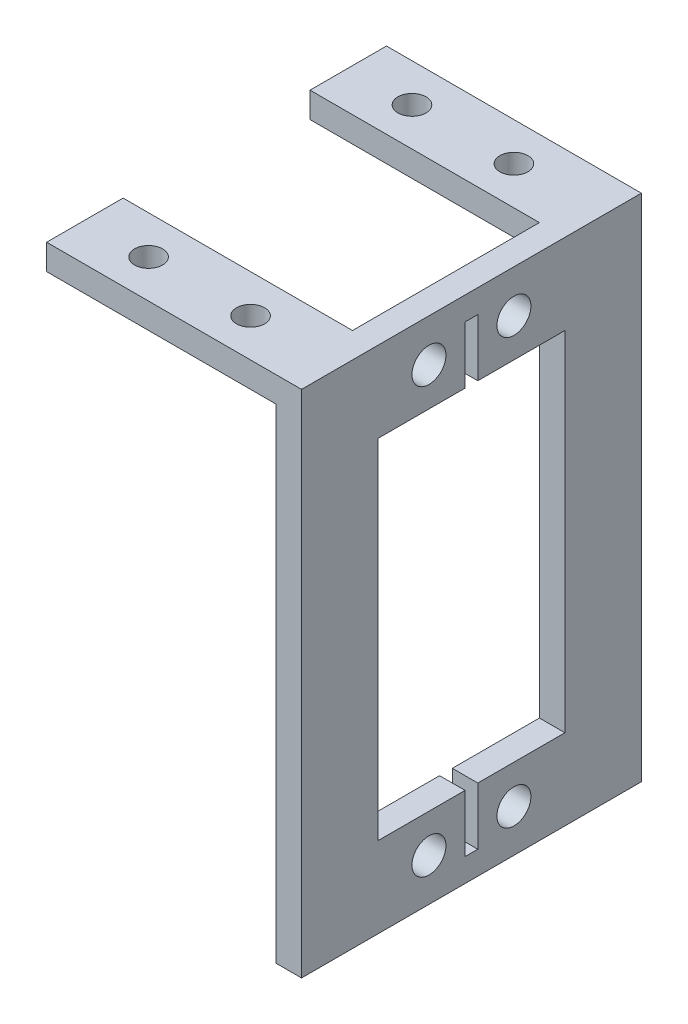
ISO-10303-21;
HEADER;
FILE_DESCRIPTION(('STEP AP214'),'2;1');
FILE_NAME('part.step','',(''),(''),'','','');
FILE_SCHEMA(('AUTOMOTIVE_DESIGN { 1 0 10303 214 1 1 1 1 }'));
ENDSEC;
DATA;
#1=APPLICATION_CONTEXT('core data for automotive mechanical design processes');
#2=APPLICATION_PROTOCOL_DEFINITION('international standard','automotive_design',2000,#1);
#3=PRODUCT_CONTEXT('',#1,'mechanical');
#4=PRODUCT('Part','Part','',(#3));
#5=PRODUCT_RELATED_PRODUCT_CATEGORY('part','',(#4));
#6=PRODUCT_DEFINITION_FORMATION('','',#4);
#7=PRODUCT_DEFINITION_CONTEXT('part definition',#1,'design');
#8=PRODUCT_DEFINITION('design','',#6,#7);
#9=PRODUCT_DEFINITION_SHAPE('','',#8);
#10=(LENGTH_UNIT() NAMED_UNIT(*) SI_UNIT(.MILLI.,.METRE.));
#11=(NAMED_UNIT(*) PLANE_ANGLE_UNIT() SI_UNIT($,.RADIAN.));
#12=(NAMED_UNIT(*) SI_UNIT($,.STERADIAN.) SOLID_ANGLE_UNIT());
#13=UNCERTAINTY_MEASURE_WITH_UNIT(LENGTH_MEASURE(1.E-05),#10,'distance_accuracy_value','');
#14=(GEOMETRIC_REPRESENTATION_CONTEXT(3) GLOBAL_UNCERTAINTY_ASSIGNED_CONTEXT((#13)) GLOBAL_UNIT_ASSIGNED_CONTEXT((#10,
#11,#12)) REPRESENTATION_CONTEXT('',''));
#15=CARTESIAN_POINT('',(0.,0.,0.));
#16=DIRECTION('',(0.,0.,1.));
#17=DIRECTION('',(1.,0.,0.));
#18=AXIS2_PLACEMENT_3D('',#15,#16,#17);
#19=CARTESIAN_POINT('',(0.,0.,40.));
#20=DIRECTION('',(1.,0.,0.));
#21=DIRECTION('',(0.,0.,-1.));
#22=AXIS2_PLACEMENT_3D('',#19,#20,#21);
#23=PLANE('',#22);
#24=DIRECTION('',(0.,0.,-1.));
#25=VECTOR('',#24,1.);
#26=CARTESIAN_POINT('',(0.,-3.,40.));
#27=LINE('',#26,#25);
#28=CARTESIAN_POINT('',(0.,-3.,9.));
#29=VERTEX_POINT('',#28);
#30=CARTESIAN_POINT('',(0.,-3.,0.));
#31=VERTEX_POINT('',#30);
#32=EDGE_CURVE('E47',#29,#31,#27,.T.);
#33=ORIENTED_EDGE('',*,*,#32,.F.);
#34=DIRECTION('',(0.,1.,0.));
#35=VECTOR('',#34,1.);
#36=CARTESIAN_POINT('',(0.,-10.,9.));
#37=LINE('',#36,#35);
#38=CARTESIAN_POINT('',(0.,0.,9.));
#39=VERTEX_POINT('',#38);
#40=EDGE_CURVE('E335',#29,#39,#37,.T.);
#41=ORIENTED_EDGE('',*,*,#40,.T.);
#42=DIRECTION('',(0.,0.,-1.));
#43=VECTOR('',#42,1.);
#44=CARTESIAN_POINT('',(0.,0.,40.));
#45=LINE('',#44,#43);
#46=CARTESIAN_POINT('',(0.,0.,0.));
#47=VERTEX_POINT('',#46);
#48=EDGE_CURVE('E376',#39,#47,#45,.T.);
#49=ORIENTED_EDGE('',*,*,#48,.T.);
#50=DIRECTION('',(0.,-1.,0.));
#51=VECTOR('',#50,1.);
#52=CARTESIAN_POINT('',(0.,0.,0.));
#53=LINE('',#52,#51);
#54=EDGE_CURVE('E361',#47,#31,#53,.T.);
#55=ORIENTED_EDGE('',*,*,#54,.T.);
#56=EDGE_LOOP('',(#33,#41,#49,#55));
#57=FACE_BOUND('',#56,.T.);
#58=ADVANCED_FACE('F39',(#57),#23,.F.);
#59=CARTESIAN_POINT('',(0.,-3.,40.));
#60=DIRECTION('',(0.,1.,0.));
#61=DIRECTION('',(0.,0.,1.));
#62=AXIS2_PLACEMENT_3D('',#59,#60,#61);
#63=PLANE('',#62);
#64=CARTESIAN_POINT('',(19.5,-3.,4.5));
#65=DIRECTION('',(0.,1.,0.));
#66=DIRECTION('',(0.,0.,1.));
#67=AXIS2_PLACEMENT_3D('',#64,#65,#66);
#68=CIRCLE('',#67,1.65);
#69=CARTESIAN_POINT('',(19.5,-3.,6.15));
#70=VERTEX_POINT('',#69);
#71=EDGE_CURVE('E352',#70,#70,#68,.T.);
#72=ORIENTED_EDGE('',*,*,#71,.T.);
#73=EDGE_LOOP('',(#72));
#74=FACE_BOUND('',#73,.T.);
#75=CARTESIAN_POINT('',(7.5,-3.,4.5));
#76=DIRECTION('',(0.,1.,0.));
#77=DIRECTION('',(0.,0.,1.));
#78=AXIS2_PLACEMENT_3D('',#75,#76,#77);
#79=CIRCLE('',#78,1.65);
#80=CARTESIAN_POINT('',(7.5,-3.,6.15));
#81=VERTEX_POINT('',#80);
#82=EDGE_CURVE('E349',#81,#81,#79,.T.);
#83=ORIENTED_EDGE('',*,*,#82,.T.);
#84=EDGE_LOOP('',(#83));
#85=FACE_BOUND('',#84,.T.);
#86=DIRECTION('',(0.,0.,-1.));
#87=VECTOR('',#86,1.);
#88=CARTESIAN_POINT('',(27.,-3.,40.));
#89=LINE('',#88,#87);
#90=CARTESIAN_POINT('',(27.,-3.,9.));
#91=VERTEX_POINT('',#90);
#92=CARTESIAN_POINT('',(27.,-3.,0.));
#93=VERTEX_POINT('',#92);
#94=EDGE_CURVE('E401',#91,#93,#89,.T.);
#95=ORIENTED_EDGE('',*,*,#94,.F.);
#96=DIRECTION('',(-1.,0.,0.));
#97=VECTOR('',#96,1.);
#98=CARTESIAN_POINT('',(0.,-3.,9.));
#99=LINE('',#98,#97);
#100=EDGE_CURVE('E346',#91,#29,#99,.T.);
#101=ORIENTED_EDGE('',*,*,#100,.T.);
#102=ORIENTED_EDGE('',*,*,#32,.T.);
#103=DIRECTION('',(1.,0.,0.));
#104=VECTOR('',#103,1.);
#105=CARTESIAN_POINT('',(0.,-3.,0.));
#106=LINE('',#105,#104);
#107=EDGE_CURVE('E379',#31,#93,#106,.T.);
#108=ORIENTED_EDGE('',*,*,#107,.T.);
#109=EDGE_LOOP('',(#95,#101,#102,#108));
#110=FACE_BOUND('',#109,.T.);
#111=ADVANCED_FACE('F414',(#74,#85,#110),#63,.F.);
#112=CARTESIAN_POINT('',(0.,0.,40.));
#113=VERTEX_POINT('',#112);
#114=CARTESIAN_POINT('',(0.,0.,31.));
#115=VERTEX_POINT('',#114);
#116=EDGE_CURVE('E390',#113,#115,#45,.T.);
#117=ORIENTED_EDGE('',*,*,#116,.T.);
#118=DIRECTION('',(0.,1.,0.));
#119=VECTOR('',#118,1.);
#120=CARTESIAN_POINT('',(0.,-10.,31.));
#121=LINE('',#120,#119);
#122=CARTESIAN_POINT('',(0.,-3.,31.));
#123=VERTEX_POINT('',#122);
#124=EDGE_CURVE('E334',#123,#115,#121,.T.);
#125=ORIENTED_EDGE('',*,*,#124,.F.);
#126=CARTESIAN_POINT('',(0.,-3.,40.));
#127=VERTEX_POINT('',#126);
#128=EDGE_CURVE('E11',#127,#123,#27,.T.);
#129=ORIENTED_EDGE('',*,*,#128,.F.);
#130=DIRECTION('',(0.,-1.,0.));
#131=VECTOR('',#130,1.);
#132=CARTESIAN_POINT('',(0.,0.,40.));
#133=LINE('',#132,#131);
#134=EDGE_CURVE('E362',#113,#127,#133,.T.);
#135=ORIENTED_EDGE('',*,*,#134,.F.);
#136=EDGE_LOOP('',(#117,#125,#129,#135));
#137=FACE_BOUND('',#136,.T.);
#138=ADVANCED_FACE('F41',(#137),#23,.F.);
#139=CARTESIAN_POINT('',(7.5,-3.,35.5));
#140=DIRECTION('',(0.,1.,0.));
#141=DIRECTION('',(0.,0.,1.));
#142=AXIS2_PLACEMENT_3D('',#139,#140,#141);
#143=CIRCLE('',#142,1.65);
#144=CARTESIAN_POINT('',(7.5,-3.,37.15));
#145=VERTEX_POINT('',#144);
#146=EDGE_CURVE('E358',#145,#145,#143,.T.);
#147=ORIENTED_EDGE('',*,*,#146,.T.);
#148=EDGE_LOOP('',(#147));
#149=FACE_BOUND('',#148,.T.);
#150=CARTESIAN_POINT('',(19.5,-3.,35.5));
#151=DIRECTION('',(0.,1.,0.));
#152=DIRECTION('',(0.,0.,1.));
#153=AXIS2_PLACEMENT_3D('',#150,#151,#152);
#154=CIRCLE('',#153,1.65);
#155=CARTESIAN_POINT('',(19.5,-3.,37.15));
#156=VERTEX_POINT('',#155);
#157=EDGE_CURVE('E355',#156,#156,#154,.T.);
#158=ORIENTED_EDGE('',*,*,#157,.T.);
#159=EDGE_LOOP('',(#158));
#160=FACE_BOUND('',#159,.T.);
#161=ORIENTED_EDGE('',*,*,#128,.T.);
#162=DIRECTION('',(1.,0.,0.));
#163=VECTOR('',#162,1.);
#164=CARTESIAN_POINT('',(0.,-3.,31.));
#165=LINE('',#164,#163);
#166=CARTESIAN_POINT('',(27.,-3.,31.));
#167=VERTEX_POINT('',#166);
#168=EDGE_CURVE('E338',#123,#167,#165,.T.);
#169=ORIENTED_EDGE('',*,*,#168,.T.);
#170=CARTESIAN_POINT('',(27.,-3.,40.));
#171=VERTEX_POINT('',#170);
#172=EDGE_CURVE('E402',#171,#167,#89,.T.);
#173=ORIENTED_EDGE('',*,*,#172,.F.);
#174=DIRECTION('',(1.,0.,0.));
#175=VECTOR('',#174,1.);
#176=CARTESIAN_POINT('',(0.,-3.,40.));
#177=LINE('',#176,#175);
#178=EDGE_CURVE('E365',#127,#171,#177,.T.);
#179=ORIENTED_EDGE('',*,*,#178,.F.);
#180=EDGE_LOOP('',(#161,#169,#173,#179));
#181=FACE_BOUND('',#180,.T.);
#182=ADVANCED_FACE('F436',(#149,#160,#181),#63,.F.);
#183=CARTESIAN_POINT('',(27.,-3.,40.));
#184=DIRECTION('',(1.,0.,0.));
#185=DIRECTION('',(0.,1.,0.));
#186=AXIS2_PLACEMENT_3D('',#183,#184,#185);
#187=PLANE('',#186);
#188=CARTESIAN_POINT('',(27.,-5.,15.));
#189=DIRECTION('',(1.,0.,0.));
#190=DIRECTION('',(0.,1.,0.));
#191=AXIS2_PLACEMENT_3D('',#188,#189,#190);
#192=CIRCLE('',#191,2.);
#193=CARTESIAN_POINT('',(27.,-3.,15.));
#194=VERTEX_POINT('',#193);
#195=EDGE_CURVE('E311',#194,#194,#192,.T.);
#196=ORIENTED_EDGE('',*,*,#195,.T.);
#197=EDGE_LOOP('',(#196));
#198=FACE_BOUND('',#197,.T.);
#199=CARTESIAN_POINT('',(27.,-55.,15.));
#200=DIRECTION('',(1.,0.,0.));
#201=DIRECTION('',(0.,1.,0.));
#202=AXIS2_PLACEMENT_3D('',#199,#200,#201);
#203=CIRCLE('',#202,2.);
#204=CARTESIAN_POINT('',(27.,-53.,15.));
#205=VERTEX_POINT('',#204);
#206=EDGE_CURVE('E308',#205,#205,#203,.T.);
#207=ORIENTED_EDGE('',*,*,#206,.T.);
#208=EDGE_LOOP('',(#207));
#209=FACE_BOUND('',#208,.T.);
#210=DIRECTION('',(0.,1.,0.));
#211=VECTOR('',#210,1.);
#212=CARTESIAN_POINT('',(27.,-3.,8.99999999999999));
#213=LINE('',#212,#211);
#214=CARTESIAN_POINT('',(27.,-50.5,8.99999999999999));
#215=VERTEX_POINT('',#214);
#216=CARTESIAN_POINT('',(27.,-9.50000000000001,8.99999999999999));
#217=VERTEX_POINT('',#216);
#218=EDGE_CURVE('E302',#215,#217,#213,.T.);
#219=ORIENTED_EDGE('',*,*,#218,.T.);
#220=DIRECTION('',(0.,0.,1.));
#221=VECTOR('',#220,1.);
#222=CARTESIAN_POINT('',(27.,-9.50000000000001,40.));
#223=LINE('',#222,#221);
#224=CARTESIAN_POINT('',(27.,-9.50000000000001,19.25));
#225=VERTEX_POINT('',#224);
#226=EDGE_CURVE('E305',#217,#225,#223,.T.);
#227=ORIENTED_EDGE('',*,*,#226,.T.);
#228=DIRECTION('',(0.,1.,0.));
#229=VECTOR('',#228,1.);
#230=CARTESIAN_POINT('',(27.,-2.99999999999999,19.25));
#231=LINE('',#230,#229);
#232=CARTESIAN_POINT('',(27.,-2.75,19.25));
#233=VERTEX_POINT('',#232);
#234=EDGE_CURVE('E275',#225,#233,#231,.T.);
#235=ORIENTED_EDGE('',*,*,#234,.T.);
#236=DIRECTION('',(0.,0.,1.));
#237=VECTOR('',#236,1.);
#238=CARTESIAN_POINT('',(27.,-2.75000000000001,40.));
#239=LINE('',#238,#237);
#240=CARTESIAN_POINT('',(27.,-2.75000000000001,20.75));
#241=VERTEX_POINT('',#240);
#242=EDGE_CURVE('E194',#233,#241,#239,.T.);
#243=ORIENTED_EDGE('',*,*,#242,.T.);
#244=DIRECTION('',(0.,-1.,0.));
#245=VECTOR('',#244,1.);
#246=CARTESIAN_POINT('',(27.,-3.,20.75));
#247=LINE('',#246,#245);
#248=CARTESIAN_POINT('',(27.,-9.50000000000001,20.75));
#249=VERTEX_POINT('',#248);
#250=EDGE_CURVE('E278',#241,#249,#247,.T.);
#251=ORIENTED_EDGE('',*,*,#250,.T.);
#252=DIRECTION('',(0.,0.,1.));
#253=VECTOR('',#252,1.);
#254=CARTESIAN_POINT('',(27.,-9.50000000000001,40.));
#255=LINE('',#254,#253);
#256=CARTESIAN_POINT('',(27.,-9.50000000000001,31.));
#257=VERTEX_POINT('',#256);
#258=EDGE_CURVE('E281',#249,#257,#255,.T.);
#259=ORIENTED_EDGE('',*,*,#258,.T.);
#260=DIRECTION('',(0.,-1.,0.));
#261=VECTOR('',#260,1.);
#262=CARTESIAN_POINT('',(27.,-3.,31.));
#263=LINE('',#262,#261);
#264=CARTESIAN_POINT('',(27.,-50.5,31.));
#265=VERTEX_POINT('',#264);
#266=EDGE_CURVE('E284',#257,#265,#263,.T.);
#267=ORIENTED_EDGE('',*,*,#266,.T.);
#268=DIRECTION('',(0.,0.,-1.));
#269=VECTOR('',#268,1.);
#270=CARTESIAN_POINT('',(27.,-50.5,39.9999999999999));
#271=LINE('',#270,#269);
#272=CARTESIAN_POINT('',(27.,-50.5,20.75));
#273=VERTEX_POINT('',#272);
#274=EDGE_CURVE('E287',#265,#273,#271,.T.);
#275=ORIENTED_EDGE('',*,*,#274,.T.);
#276=DIRECTION('',(0.,-1.,0.));
#277=VECTOR('',#276,1.);
#278=CARTESIAN_POINT('',(27.,-3.,20.75));
#279=LINE('',#278,#277);
#280=CARTESIAN_POINT('',(27.,-57.25,20.75));
#281=VERTEX_POINT('',#280);
#282=EDGE_CURVE('E290',#273,#281,#279,.T.);
#283=ORIENTED_EDGE('',*,*,#282,.T.);
#284=DIRECTION('',(0.,0.,-1.));
#285=VECTOR('',#284,1.);
#286=CARTESIAN_POINT('',(27.,-57.25,40.));
#287=LINE('',#286,#285);
#288=CARTESIAN_POINT('',(27.,-57.25,19.25));
#289=VERTEX_POINT('',#288);
#290=EDGE_CURVE('E293',#281,#289,#287,.T.);
#291=ORIENTED_EDGE('',*,*,#290,.T.);
#292=DIRECTION('',(0.,1.,0.));
#293=VECTOR('',#292,1.);
#294=CARTESIAN_POINT('',(27.,-3.00000000000001,19.25));
#295=LINE('',#294,#293);
#296=CARTESIAN_POINT('',(27.,-50.5,19.25));
#297=VERTEX_POINT('',#296);
#298=EDGE_CURVE('E296',#289,#297,#295,.T.);
#299=ORIENTED_EDGE('',*,*,#298,.T.);
#300=DIRECTION('',(0.,0.,-1.));
#301=VECTOR('',#300,1.);
#302=CARTESIAN_POINT('',(27.,-50.5,40.0000000000001));
#303=LINE('',#302,#301);
#304=EDGE_CURVE('E299',#297,#215,#303,.T.);
#305=ORIENTED_EDGE('',*,*,#304,.T.);
#306=EDGE_LOOP('',(#219,#227,#235,#243,#251,#259,#267,#275,#283,#291,#299,#305));
#307=FACE_BOUND('',#306,.T.);
#308=CARTESIAN_POINT('',(27.,-55.,25.));
#309=DIRECTION('',(1.,0.,0.));
#310=DIRECTION('',(0.,1.,0.));
#311=AXIS2_PLACEMENT_3D('',#308,#309,#310);
#312=CIRCLE('',#311,2.);
#313=CARTESIAN_POINT('',(27.,-53.,25.));
#314=VERTEX_POINT('',#313);
#315=EDGE_CURVE('E272',#314,#314,#312,.T.);
#316=ORIENTED_EDGE('',*,*,#315,.T.);
#317=EDGE_LOOP('',(#316));
#318=FACE_BOUND('',#317,.T.);
#319=CARTESIAN_POINT('',(27.,-5.,25.));
#320=DIRECTION('',(1.,0.,0.));
#321=DIRECTION('',(0.,1.,0.));
#322=AXIS2_PLACEMENT_3D('',#319,#320,#321);
#323=CIRCLE('',#322,2.);
#324=CARTESIAN_POINT('',(27.,-3.,25.));
#325=VERTEX_POINT('',#324);
#326=EDGE_CURVE('E269',#325,#325,#323,.T.);
#327=ORIENTED_EDGE('',*,*,#326,.T.);
#328=EDGE_LOOP('',(#327));
#329=FACE_BOUND('',#328,.T.);
#330=ORIENTED_EDGE('',*,*,#172,.T.);
#331=DIRECTION('',(0.,1.,0.));
#332=VECTOR('',#331,1.);
#333=CARTESIAN_POINT('',(27.,-10.,31.));
#334=LINE('',#333,#332);
#335=CARTESIAN_POINT('',(27.,0.,31.));
#336=VERTEX_POINT('',#335);
#337=EDGE_CURVE('E341',#167,#336,#334,.T.);
#338=ORIENTED_EDGE('',*,*,#337,.T.);
#339=DIRECTION('',(0.,0.,-1.));
#340=VECTOR('',#339,1.);
#341=CARTESIAN_POINT('',(27.,0.,9.));
#342=LINE('',#341,#340);
#343=CARTESIAN_POINT('',(27.,0.,9.));
#344=VERTEX_POINT('',#343);
#345=EDGE_CURVE('E329',#336,#344,#342,.T.);
#346=ORIENTED_EDGE('',*,*,#345,.T.);
#347=DIRECTION('',(0.,1.,0.));
#348=VECTOR('',#347,1.);
#349=CARTESIAN_POINT('',(27.,-10.,9.));
#350=LINE('',#349,#348);
#351=EDGE_CURVE('E339',#91,#344,#350,.T.);
#352=ORIENTED_EDGE('',*,*,#351,.F.);
#353=ORIENTED_EDGE('',*,*,#94,.T.);
#354=DIRECTION('',(0.,-1.,0.));
#355=VECTOR('',#354,1.);
#356=CARTESIAN_POINT('',(27.,-3.,0.));
#357=LINE('',#356,#355);
#358=CARTESIAN_POINT('',(27.,-60.,0.));
#359=VERTEX_POINT('',#358);
#360=EDGE_CURVE('E382',#93,#359,#357,.T.);
#361=ORIENTED_EDGE('',*,*,#360,.T.);
#362=DIRECTION('',(0.,0.,-1.));
#363=VECTOR('',#362,1.);
#364=CARTESIAN_POINT('',(27.,-60.,40.));
#365=LINE('',#364,#363);
#366=CARTESIAN_POINT('',(27.,-60.,40.));
#367=VERTEX_POINT('',#366);
#368=EDGE_CURVE('E399',#367,#359,#365,.T.);
#369=ORIENTED_EDGE('',*,*,#368,.F.);
#370=DIRECTION('',(0.,-1.,0.));
#371=VECTOR('',#370,1.);
#372=CARTESIAN_POINT('',(27.,-3.,40.));
#373=LINE('',#372,#371);
#374=EDGE_CURVE('E368',#171,#367,#373,.T.);
#375=ORIENTED_EDGE('',*,*,#374,.F.);
#376=EDGE_LOOP('',(#330,#338,#346,#352,#353,#361,#369,#375));
#377=FACE_BOUND('',#376,.T.);
#378=ADVANCED_FACE('F409',(#198,#209,#307,#318,#329,#377),#187,.F.);
#379=CARTESIAN_POINT('',(27.,-60.,40.));
#380=DIRECTION('',(0.,1.,0.));
#381=DIRECTION('',(0.,0.,1.));
#382=AXIS2_PLACEMENT_3D('',#379,#380,#381);
#383=PLANE('',#382);
#384=DIRECTION('',(1.,0.,0.));
#385=VECTOR('',#384,1.);
#386=CARTESIAN_POINT('',(27.,-60.,0.));
#387=LINE('',#386,#385);
#388=CARTESIAN_POINT('',(30.,-60.,0.));
#389=VERTEX_POINT('',#388);
#390=EDGE_CURVE('E384',#359,#389,#387,.T.);
#391=ORIENTED_EDGE('',*,*,#390,.T.);
#392=DIRECTION('',(0.,0.,-1.));
#393=VECTOR('',#392,1.);
#394=CARTESIAN_POINT('',(30.,-60.,40.));
#395=LINE('',#394,#393);
#396=CARTESIAN_POINT('',(30.,-60.,40.));
#397=VERTEX_POINT('',#396);
#398=EDGE_CURVE('E396',#397,#389,#395,.T.);
#399=ORIENTED_EDGE('',*,*,#398,.F.);
#400=DIRECTION('',(1.,0.,0.));
#401=VECTOR('',#400,1.);
#402=CARTESIAN_POINT('',(27.,-60.,40.));
#403=LINE('',#402,#401);
#404=EDGE_CURVE('E370',#367,#397,#403,.T.);
#405=ORIENTED_EDGE('',*,*,#404,.F.);
#406=ORIENTED_EDGE('',*,*,#368,.T.);
#407=EDGE_LOOP('',(#391,#399,#405,#406));
#408=FACE_BOUND('',#407,.T.);
#409=ADVANCED_FACE('F424',(#408),#383,.F.);
#410=CARTESIAN_POINT('',(30.,0.,40.));
#411=DIRECTION('',(-1.,0.,0.));
#412=DIRECTION('',(0.,-1.,0.));
#413=AXIS2_PLACEMENT_3D('',#410,#411,#412);
#414=PLANE('',#413);
#415=CARTESIAN_POINT('',(30.,-5.,15.));
#416=DIRECTION('',(1.,0.,0.));
#417=DIRECTION('',(0.,1.,0.));
#418=AXIS2_PLACEMENT_3D('',#415,#416,#417);
#419=CIRCLE('',#418,2.);
#420=CARTESIAN_POINT('',(30.,-3.,15.));
#421=VERTEX_POINT('',#420);
#422=EDGE_CURVE('E261',#421,#421,#419,.T.);
#423=ORIENTED_EDGE('',*,*,#422,.F.);
#424=EDGE_LOOP('',(#423));
#425=FACE_BOUND('',#424,.T.);
#426=CARTESIAN_POINT('',(30.,-55.,15.));
#427=DIRECTION('',(1.,0.,0.));
#428=DIRECTION('',(0.,1.,0.));
#429=AXIS2_PLACEMENT_3D('',#426,#427,#428);
#430=CIRCLE('',#429,2.);
#431=CARTESIAN_POINT('',(30.,-53.,15.));
#432=VERTEX_POINT('',#431);
#433=EDGE_CURVE('E260',#432,#432,#430,.T.);
#434=ORIENTED_EDGE('',*,*,#433,.F.);
#435=EDGE_LOOP('',(#434));
#436=FACE_BOUND('',#435,.T.);
#437=DIRECTION('',(0.,1.,0.));
#438=VECTOR('',#437,1.);
#439=CARTESIAN_POINT('',(30.,-2.75,19.25));
#440=LINE('',#439,#438);
#441=CARTESIAN_POINT('',(30.,-9.50000000000001,19.25));
#442=VERTEX_POINT('',#441);
#443=CARTESIAN_POINT('',(30.,-2.75,19.25));
#444=VERTEX_POINT('',#443);
#445=EDGE_CURVE('E200',#442,#444,#440,.T.);
#446=ORIENTED_EDGE('',*,*,#445,.F.);
#447=DIRECTION('',(0.,0.,1.));
#448=VECTOR('',#447,1.);
#449=CARTESIAN_POINT('',(30.,-9.50000000000001,19.25));
#450=LINE('',#449,#448);
#451=CARTESIAN_POINT('',(30.,-9.50000000000001,8.99999999999999));
#452=VERTEX_POINT('',#451);
#453=EDGE_CURVE('E62',#452,#442,#450,.T.);
#454=ORIENTED_EDGE('',*,*,#453,.F.);
#455=DIRECTION('',(0.,1.,0.));
#456=VECTOR('',#455,1.);
#457=CARTESIAN_POINT('',(30.,-50.5,8.99999999999999));
#458=LINE('',#457,#456);
#459=CARTESIAN_POINT('',(30.,-50.5,8.99999999999999));
#460=VERTEX_POINT('',#459);
#461=EDGE_CURVE('E234',#460,#452,#458,.T.);
#462=ORIENTED_EDGE('',*,*,#461,.F.);
#463=DIRECTION('',(0.,0.,-1.));
#464=VECTOR('',#463,1.);
#465=CARTESIAN_POINT('',(30.,-50.5,19.25));
#466=LINE('',#465,#464);
#467=CARTESIAN_POINT('',(30.,-50.5,19.25));
#468=VERTEX_POINT('',#467);
#469=EDGE_CURVE('E231',#468,#460,#466,.T.);
#470=ORIENTED_EDGE('',*,*,#469,.F.);
#471=DIRECTION('',(0.,1.,0.));
#472=VECTOR('',#471,1.);
#473=CARTESIAN_POINT('',(30.,-57.25,19.25));
#474=LINE('',#473,#472);
#475=CARTESIAN_POINT('',(30.,-57.25,19.25));
#476=VERTEX_POINT('',#475);
#477=EDGE_CURVE('E228',#476,#468,#474,.T.);
#478=ORIENTED_EDGE('',*,*,#477,.F.);
#479=DIRECTION('',(0.,0.,-1.));
#480=VECTOR('',#479,1.);
#481=CARTESIAN_POINT('',(30.,-57.25,20.75));
#482=LINE('',#481,#480);
#483=CARTESIAN_POINT('',(30.,-57.25,20.75));
#484=VERTEX_POINT('',#483);
#485=EDGE_CURVE('E225',#484,#476,#482,.T.);
#486=ORIENTED_EDGE('',*,*,#485,.F.);
#487=DIRECTION('',(0.,-1.,0.));
#488=VECTOR('',#487,1.);
#489=CARTESIAN_POINT('',(30.,-50.5,20.75));
#490=LINE('',#489,#488);
#491=CARTESIAN_POINT('',(30.,-50.5,20.75));
#492=VERTEX_POINT('',#491);
#493=EDGE_CURVE('E222',#492,#484,#490,.T.);
#494=ORIENTED_EDGE('',*,*,#493,.F.);
#495=DIRECTION('',(0.,0.,-1.));
#496=VECTOR('',#495,1.);
#497=CARTESIAN_POINT('',(30.,-50.5,31.));
#498=LINE('',#497,#496);
#499=CARTESIAN_POINT('',(30.,-50.5,31.));
#500=VERTEX_POINT('',#499);
#501=EDGE_CURVE('E219',#500,#492,#498,.T.);
#502=ORIENTED_EDGE('',*,*,#501,.F.);
#503=DIRECTION('',(0.,-1.,0.));
#504=VECTOR('',#503,1.);
#505=CARTESIAN_POINT('',(30.,-50.5,31.));
#506=LINE('',#505,#504);
#507=CARTESIAN_POINT('',(30.,-9.50000000000001,31.));
#508=VERTEX_POINT('',#507);
#509=EDGE_CURVE('E216',#508,#500,#506,.T.);
#510=ORIENTED_EDGE('',*,*,#509,.F.);
#511=DIRECTION('',(0.,0.,1.));
#512=VECTOR('',#511,1.);
#513=CARTESIAN_POINT('',(30.,-9.50000000000001,31.));
#514=LINE('',#513,#512);
#515=CARTESIAN_POINT('',(30.,-9.50000000000001,20.75));
#516=VERTEX_POINT('',#515);
#517=EDGE_CURVE('E210',#516,#508,#514,.T.);
#518=ORIENTED_EDGE('',*,*,#517,.F.);
#519=DIRECTION('',(0.,-1.,0.));
#520=VECTOR('',#519,1.);
#521=CARTESIAN_POINT('',(30.,-9.50000000000001,20.75));
#522=LINE('',#521,#520);
#523=CARTESIAN_POINT('',(30.,-2.75,20.75));
#524=VERTEX_POINT('',#523);
#525=EDGE_CURVE('E208',#524,#516,#522,.T.);
#526=ORIENTED_EDGE('',*,*,#525,.F.);
#527=DIRECTION('',(0.,0.,1.));
#528=VECTOR('',#527,1.);
#529=CARTESIAN_POINT('',(30.,-2.75,20.75));
#530=LINE('',#529,#528);
#531=EDGE_CURVE('E191',#444,#524,#530,.T.);
#532=ORIENTED_EDGE('',*,*,#531,.F.);
#533=EDGE_LOOP('',(#446,#454,#462,#470,#478,#486,#494,#502,#510,#518,#526,#532));
#534=FACE_BOUND('',#533,.T.);
#535=CARTESIAN_POINT('',(30.,-55.,25.));
#536=DIRECTION('',(1.,0.,0.));
#537=DIRECTION('',(0.,-1.,0.));
#538=AXIS2_PLACEMENT_3D('',#535,#536,#537);
#539=CIRCLE('',#538,2.);
#540=CARTESIAN_POINT('',(30.,-57.,25.));
#541=VERTEX_POINT('',#540);
#542=EDGE_CURVE('E239',#541,#541,#539,.T.);
#543=ORIENTED_EDGE('',*,*,#542,.F.);
#544=EDGE_LOOP('',(#543));
#545=FACE_BOUND('',#544,.T.);
#546=CARTESIAN_POINT('',(30.,-5.,25.));
#547=DIRECTION('',(1.,0.,0.));
#548=DIRECTION('',(0.,1.,0.));
#549=AXIS2_PLACEMENT_3D('',#546,#547,#548);
#550=CIRCLE('',#549,2.);
#551=CARTESIAN_POINT('',(30.,-3.,25.));
#552=VERTEX_POINT('',#551);
#553=EDGE_CURVE('E264',#552,#552,#550,.T.);
#554=ORIENTED_EDGE('',*,*,#553,.F.);
#555=EDGE_LOOP('',(#554));
#556=FACE_BOUND('',#555,.T.);
#557=DIRECTION('',(0.,1.,0.));
#558=VECTOR('',#557,1.);
#559=CARTESIAN_POINT('',(30.,0.,0.));
#560=LINE('',#559,#558);
#561=CARTESIAN_POINT('',(30.,0.,0.));
#562=VERTEX_POINT('',#561);
#563=EDGE_CURVE('E386',#389,#562,#560,.T.);
#564=ORIENTED_EDGE('',*,*,#563,.T.);
#565=DIRECTION('',(0.,0.,-1.));
#566=VECTOR('',#565,1.);
#567=CARTESIAN_POINT('',(30.,0.,40.));
#568=LINE('',#567,#566);
#569=CARTESIAN_POINT('',(30.,0.,40.));
#570=VERTEX_POINT('',#569);
#571=EDGE_CURVE('E393',#570,#562,#568,.T.);
#572=ORIENTED_EDGE('',*,*,#571,.F.);
#573=DIRECTION('',(0.,1.,0.));
#574=VECTOR('',#573,1.);
#575=CARTESIAN_POINT('',(30.,0.,40.));
#576=LINE('',#575,#574);
#577=EDGE_CURVE('E372',#397,#570,#576,.T.);
#578=ORIENTED_EDGE('',*,*,#577,.F.);
#579=ORIENTED_EDGE('',*,*,#398,.T.);
#580=EDGE_LOOP('',(#564,#572,#578,#579));
#581=FACE_BOUND('',#580,.T.);
#582=ADVANCED_FACE('F204',(#425,#436,#534,#545,#556,#581),#414,.F.);
#583=CARTESIAN_POINT('',(0.,0.,40.));
#584=DIRECTION('',(0.,-1.,0.));
#585=DIRECTION('',(0.,0.,-1.));
#586=AXIS2_PLACEMENT_3D('',#583,#584,#585);
#587=PLANE('',#586);
#588=CARTESIAN_POINT('',(7.5,0.,35.5));
#589=DIRECTION('',(0.,1.,0.));
#590=DIRECTION('',(0.,0.,-1.));
#591=AXIS2_PLACEMENT_3D('',#588,#589,#590);
#592=CIRCLE('',#591,1.65);
#593=CARTESIAN_POINT('',(7.5,0.,33.85));
#594=VERTEX_POINT('',#593);
#595=EDGE_CURVE('E314',#594,#594,#592,.T.);
#596=ORIENTED_EDGE('',*,*,#595,.F.);
#597=EDGE_LOOP('',(#596));
#598=FACE_BOUND('',#597,.T.);
#599=CARTESIAN_POINT('',(19.5,0.,35.5));
#600=DIRECTION('',(0.,1.,0.));
#601=DIRECTION('',(0.,0.,-1.));
#602=AXIS2_PLACEMENT_3D('',#599,#600,#601);
#603=CIRCLE('',#602,1.65);
#604=CARTESIAN_POINT('',(19.5,0.,33.85));
#605=VERTEX_POINT('',#604);
#606=EDGE_CURVE('E322',#605,#605,#603,.T.);
#607=ORIENTED_EDGE('',*,*,#606,.F.);
#608=EDGE_LOOP('',(#607));
#609=FACE_BOUND('',#608,.T.);
#610=CARTESIAN_POINT('',(19.5,0.,4.5));
#611=DIRECTION('',(0.,1.,0.));
#612=DIRECTION('',(0.,0.,1.));
#613=AXIS2_PLACEMENT_3D('',#610,#611,#612);
#614=CIRCLE('',#613,1.65);
#615=CARTESIAN_POINT('',(19.5,0.,6.15));
#616=VERTEX_POINT('',#615);
#617=EDGE_CURVE('E319',#616,#616,#614,.T.);
#618=ORIENTED_EDGE('',*,*,#617,.F.);
#619=EDGE_LOOP('',(#618));
#620=FACE_BOUND('',#619,.T.);
#621=CARTESIAN_POINT('',(7.5,0.,4.5));
#622=DIRECTION('',(0.,1.,0.));
#623=DIRECTION('',(0.,0.,1.));
#624=AXIS2_PLACEMENT_3D('',#621,#622,#623);
#625=CIRCLE('',#624,1.65);
#626=CARTESIAN_POINT('',(7.5,0.,6.15));
#627=VERTEX_POINT('',#626);
#628=EDGE_CURVE('E315',#627,#627,#625,.T.);
#629=ORIENTED_EDGE('',*,*,#628,.F.);
#630=EDGE_LOOP('',(#629));
#631=FACE_BOUND('',#630,.T.);
#632=ORIENTED_EDGE('',*,*,#48,.F.);
#633=DIRECTION('',(-1.,0.,0.));
#634=VECTOR('',#633,1.);
#635=CARTESIAN_POINT('',(0.,0.,9.));
#636=LINE('',#635,#634);
#637=EDGE_CURVE('E332',#344,#39,#636,.T.);
#638=ORIENTED_EDGE('',*,*,#637,.F.);
#639=ORIENTED_EDGE('',*,*,#345,.F.);
#640=DIRECTION('',(1.,0.,0.));
#641=VECTOR('',#640,1.);
#642=CARTESIAN_POINT('',(0.,0.,31.));
#643=LINE('',#642,#641);
#644=EDGE_CURVE('E318',#115,#336,#643,.T.);
#645=ORIENTED_EDGE('',*,*,#644,.F.);
#646=ORIENTED_EDGE('',*,*,#116,.F.);
#647=DIRECTION('',(-1.,0.,0.));
#648=VECTOR('',#647,1.);
#649=CARTESIAN_POINT('',(0.,0.,40.));
#650=LINE('',#649,#648);
#651=EDGE_CURVE('E374',#570,#113,#650,.T.);
#652=ORIENTED_EDGE('',*,*,#651,.F.);
#653=ORIENTED_EDGE('',*,*,#571,.T.);
#654=DIRECTION('',(-1.,0.,0.));
#655=VECTOR('',#654,1.);
#656=CARTESIAN_POINT('',(0.,0.,0.));
#657=LINE('',#656,#655);
#658=EDGE_CURVE('E366',#562,#47,#657,.T.);
#659=ORIENTED_EDGE('',*,*,#658,.T.);
#660=EDGE_LOOP('',(#632,#638,#639,#645,#646,#652,#653,#659));
#661=FACE_BOUND('',#660,.T.);
#662=ADVANCED_FACE('F444',(#598,#609,#620,#631,#661),#587,.F.);
#663=CARTESIAN_POINT('',(0.,0.,40.));
#664=DIRECTION('',(0.,0.,1.));
#665=DIRECTION('',(1.,0.,0.));
#666=AXIS2_PLACEMENT_3D('',#663,#664,#665);
#667=PLANE('',#666);
#668=ORIENTED_EDGE('',*,*,#134,.T.);
#669=ORIENTED_EDGE('',*,*,#178,.T.);
#670=ORIENTED_EDGE('',*,*,#374,.T.);
#671=ORIENTED_EDGE('',*,*,#404,.T.);
#672=ORIENTED_EDGE('',*,*,#577,.T.);
#673=ORIENTED_EDGE('',*,*,#651,.T.);
#674=EDGE_LOOP('',(#668,#669,#670,#671,#672,#673));
#675=FACE_BOUND('',#674,.T.);
#676=ADVANCED_FACE('F431',(#675),#667,.T.);
#677=CARTESIAN_POINT('',(0.,0.,0.));
#678=DIRECTION('',(0.,0.,1.));
#679=DIRECTION('',(1.,0.,0.));
#680=AXIS2_PLACEMENT_3D('',#677,#678,#679);
#681=PLANE('',#680);
#682=ORIENTED_EDGE('',*,*,#54,.F.);
#683=ORIENTED_EDGE('',*,*,#658,.F.);
#684=ORIENTED_EDGE('',*,*,#563,.F.);
#685=ORIENTED_EDGE('',*,*,#390,.F.);
#686=ORIENTED_EDGE('',*,*,#360,.F.);
#687=ORIENTED_EDGE('',*,*,#107,.F.);
#688=EDGE_LOOP('',(#682,#683,#684,#685,#686,#687));
#689=FACE_BOUND('',#688,.T.);
#690=ADVANCED_FACE('F419',(#689),#681,.F.);
#691=CARTESIAN_POINT('',(0.,-10.,9.));
#692=DIRECTION('',(0.,0.,-1.));
#693=DIRECTION('',(-1.,0.,0.));
#694=AXIS2_PLACEMENT_3D('',#691,#692,#693);
#695=PLANE('',#694);
#696=ORIENTED_EDGE('',*,*,#351,.T.);
#697=ORIENTED_EDGE('',*,*,#637,.T.);
#698=ORIENTED_EDGE('',*,*,#40,.F.);
#699=ORIENTED_EDGE('',*,*,#100,.F.);
#700=EDGE_LOOP('',(#696,#697,#698,#699));
#701=FACE_BOUND('',#700,.T.);
#702=ADVANCED_FACE('F448',(#701),#695,.F.);
#703=CARTESIAN_POINT('',(0.,-10.,31.));
#704=DIRECTION('',(0.,0.,1.));
#705=DIRECTION('',(1.,0.,0.));
#706=AXIS2_PLACEMENT_3D('',#703,#704,#705);
#707=PLANE('',#706);
#708=ORIENTED_EDGE('',*,*,#124,.T.);
#709=ORIENTED_EDGE('',*,*,#644,.T.);
#710=ORIENTED_EDGE('',*,*,#337,.F.);
#711=ORIENTED_EDGE('',*,*,#168,.F.);
#712=EDGE_LOOP('',(#708,#709,#710,#711));
#713=FACE_BOUND('',#712,.T.);
#714=ADVANCED_FACE('F439',(#713),#707,.F.);
#715=CARTESIAN_POINT('',(7.5,-10.,4.5));
#716=DIRECTION('',(0.,1.,0.));
#717=DIRECTION('',(0.,0.,1.));
#718=AXIS2_PLACEMENT_3D('',#715,#716,#717);
#719=CYLINDRICAL_SURFACE('',#718,1.65);
#720=ORIENTED_EDGE('',*,*,#628,.T.);
#721=EDGE_LOOP('',(#720));
#722=FACE_BOUND('',#721,.T.);
#723=ORIENTED_EDGE('',*,*,#82,.F.);
#724=EDGE_LOOP('',(#723));
#725=FACE_BOUND('',#724,.T.);
#726=ADVANCED_FACE('F481',(#722,#725),#719,.F.);
#727=CARTESIAN_POINT('',(19.5,-10.,4.5));
#728=DIRECTION('',(0.,1.,0.));
#729=DIRECTION('',(0.,0.,1.));
#730=AXIS2_PLACEMENT_3D('',#727,#728,#729);
#731=CYLINDRICAL_SURFACE('',#730,1.65);
#732=ORIENTED_EDGE('',*,*,#617,.T.);
#733=EDGE_LOOP('',(#732));
#734=FACE_BOUND('',#733,.T.);
#735=ORIENTED_EDGE('',*,*,#71,.F.);
#736=EDGE_LOOP('',(#735));
#737=FACE_BOUND('',#736,.T.);
#738=ADVANCED_FACE('F492',(#734,#737),#731,.F.);
#739=CARTESIAN_POINT('',(19.5,-10.,35.5));
#740=DIRECTION('',(0.,1.,0.));
#741=DIRECTION('',(0.,0.,1.));
#742=AXIS2_PLACEMENT_3D('',#739,#740,#741);
#743=CYLINDRICAL_SURFACE('',#742,1.65);
#744=ORIENTED_EDGE('',*,*,#606,.T.);
#745=EDGE_LOOP('',(#744));
#746=FACE_BOUND('',#745,.T.);
#747=ORIENTED_EDGE('',*,*,#157,.F.);
#748=EDGE_LOOP('',(#747));
#749=FACE_BOUND('',#748,.T.);
#750=ADVANCED_FACE('F488',(#746,#749),#743,.F.);
#751=CARTESIAN_POINT('',(7.5,-10.,35.5));
#752=DIRECTION('',(0.,1.,0.));
#753=DIRECTION('',(0.,0.,1.));
#754=AXIS2_PLACEMENT_3D('',#751,#752,#753);
#755=CYLINDRICAL_SURFACE('',#754,1.65);
#756=ORIENTED_EDGE('',*,*,#595,.T.);
#757=EDGE_LOOP('',(#756));
#758=FACE_BOUND('',#757,.T.);
#759=ORIENTED_EDGE('',*,*,#146,.F.);
#760=EDGE_LOOP('',(#759));
#761=FACE_BOUND('',#760,.T.);
#762=ADVANCED_FACE('F484',(#758,#761),#755,.F.);
#763=CARTESIAN_POINT('',(20.,-5.,25.));
#764=DIRECTION('',(1.,0.,0.));
#765=DIRECTION('',(0.,1.,0.));
#766=AXIS2_PLACEMENT_3D('',#763,#764,#765);
#767=CYLINDRICAL_SURFACE('',#766,2.);
#768=ORIENTED_EDGE('',*,*,#553,.T.);
#769=EDGE_LOOP('',(#768));
#770=FACE_BOUND('',#769,.T.);
#771=ORIENTED_EDGE('',*,*,#326,.F.);
#772=EDGE_LOOP('',(#771));
#773=FACE_BOUND('',#772,.T.);
#774=ADVANCED_FACE('F487',(#770,#773),#767,.F.);
#775=CARTESIAN_POINT('',(20.,-55.,25.));
#776=DIRECTION('',(1.,0.,0.));
#777=DIRECTION('',(0.,1.,0.));
#778=AXIS2_PLACEMENT_3D('',#775,#776,#777);
#779=CYLINDRICAL_SURFACE('',#778,2.);
#780=ORIENTED_EDGE('',*,*,#542,.T.);
#781=EDGE_LOOP('',(#780));
#782=FACE_BOUND('',#781,.T.);
#783=ORIENTED_EDGE('',*,*,#315,.F.);
#784=EDGE_LOOP('',(#783));
#785=FACE_BOUND('',#784,.T.);
#786=ADVANCED_FACE('F502',(#782,#785),#779,.F.);
#787=CARTESIAN_POINT('',(20.,-9.50000000000001,19.25));
#788=DIRECTION('',(0.,1.,0.));
#789=DIRECTION('',(-1.,0.,0.));
#790=AXIS2_PLACEMENT_3D('',#787,#788,#789);
#791=PLANE('',#790);
#792=DIRECTION('',(1.,0.,0.));
#793=VECTOR('',#792,1.);
#794=CARTESIAN_POINT('',(20.,-9.50000000000001,8.99999999999999));
#795=LINE('',#794,#793);
#796=EDGE_CURVE('E237',#217,#452,#795,.T.);
#797=ORIENTED_EDGE('',*,*,#796,.T.);
#798=ORIENTED_EDGE('',*,*,#453,.T.);
#799=DIRECTION('',(1.,0.,0.));
#800=VECTOR('',#799,1.);
#801=CARTESIAN_POINT('',(20.,-9.50000000000001,19.25));
#802=LINE('',#801,#800);
#803=EDGE_CURVE('E197',#225,#442,#802,.T.);
#804=ORIENTED_EDGE('',*,*,#803,.F.);
#805=ORIENTED_EDGE('',*,*,#226,.F.);
#806=EDGE_LOOP('',(#797,#798,#804,#805));
#807=FACE_BOUND('',#806,.T.);
#808=ADVANCED_FACE('F514',(#807),#791,.F.);
#809=CARTESIAN_POINT('',(20.,-50.5,8.99999999999999));
#810=DIRECTION('',(0.,0.,-1.));
#811=DIRECTION('',(-1.,0.,0.));
#812=AXIS2_PLACEMENT_3D('',#809,#810,#811);
#813=PLANE('',#812);
#814=DIRECTION('',(1.,0.,0.));
#815=VECTOR('',#814,1.);
#816=CARTESIAN_POINT('',(20.,-50.5,8.99999999999999));
#817=LINE('',#816,#815);
#818=EDGE_CURVE('E240',#215,#460,#817,.T.);
#819=ORIENTED_EDGE('',*,*,#818,.T.);
#820=ORIENTED_EDGE('',*,*,#461,.T.);
#821=ORIENTED_EDGE('',*,*,#796,.F.);
#822=ORIENTED_EDGE('',*,*,#218,.F.);
#823=EDGE_LOOP('',(#819,#820,#821,#822));
#824=FACE_BOUND('',#823,.T.);
#825=ADVANCED_FACE('F518',(#824),#813,.F.);
#826=CARTESIAN_POINT('',(20.,-50.5,19.25));
#827=DIRECTION('',(0.,-1.,0.));
#828=DIRECTION('',(0.,0.,-1.));
#829=AXIS2_PLACEMENT_3D('',#826,#827,#828);
#830=PLANE('',#829);
#831=DIRECTION('',(1.,0.,0.));
#832=VECTOR('',#831,1.);
#833=CARTESIAN_POINT('',(20.,-50.5,19.25));
#834=LINE('',#833,#832);
#835=EDGE_CURVE('E242',#297,#468,#834,.T.);
#836=ORIENTED_EDGE('',*,*,#835,.T.);
#837=ORIENTED_EDGE('',*,*,#469,.T.);
#838=ORIENTED_EDGE('',*,*,#818,.F.);
#839=ORIENTED_EDGE('',*,*,#304,.F.);
#840=EDGE_LOOP('',(#836,#837,#838,#839));
#841=FACE_BOUND('',#840,.T.);
#842=ADVANCED_FACE('F550',(#841),#830,.F.);
#843=CARTESIAN_POINT('',(20.,-57.25,19.25));
#844=DIRECTION('',(0.,0.,-1.));
#845=DIRECTION('',(0.,1.,0.));
#846=AXIS2_PLACEMENT_3D('',#843,#844,#845);
#847=PLANE('',#846);
#848=DIRECTION('',(1.,0.,0.));
#849=VECTOR('',#848,1.);
#850=CARTESIAN_POINT('',(20.,-57.25,19.25));
#851=LINE('',#850,#849);
#852=EDGE_CURVE('E244',#289,#476,#851,.T.);
#853=ORIENTED_EDGE('',*,*,#852,.T.);
#854=ORIENTED_EDGE('',*,*,#477,.T.);
#855=ORIENTED_EDGE('',*,*,#835,.F.);
#856=ORIENTED_EDGE('',*,*,#298,.F.);
#857=EDGE_LOOP('',(#853,#854,#855,#856));
#858=FACE_BOUND('',#857,.T.);
#859=ADVANCED_FACE('F546',(#858),#847,.F.);
#860=CARTESIAN_POINT('',(20.,-57.25,20.75));
#861=DIRECTION('',(0.,-1.,0.));
#862=DIRECTION('',(1.,0.,0.));
#863=AXIS2_PLACEMENT_3D('',#860,#861,#862);
#864=PLANE('',#863);
#865=DIRECTION('',(1.,0.,0.));
#866=VECTOR('',#865,1.);
#867=CARTESIAN_POINT('',(20.,-57.25,20.75));
#868=LINE('',#867,#866);
#869=EDGE_CURVE('E246',#281,#484,#868,.T.);
#870=ORIENTED_EDGE('',*,*,#869,.T.);
#871=ORIENTED_EDGE('',*,*,#485,.T.);
#872=ORIENTED_EDGE('',*,*,#852,.F.);
#873=ORIENTED_EDGE('',*,*,#290,.F.);
#874=EDGE_LOOP('',(#870,#871,#872,#873));
#875=FACE_BOUND('',#874,.T.);
#876=ADVANCED_FACE('F542',(#875),#864,.F.);
#877=CARTESIAN_POINT('',(20.,-50.5,20.75));
#878=DIRECTION('',(0.,0.,1.));
#879=DIRECTION('',(1.,0.,0.));
#880=AXIS2_PLACEMENT_3D('',#877,#878,#879);
#881=PLANE('',#880);
#882=DIRECTION('',(1.,0.,0.));
#883=VECTOR('',#882,1.);
#884=CARTESIAN_POINT('',(20.,-50.5,20.75));
#885=LINE('',#884,#883);
#886=EDGE_CURVE('E248',#273,#492,#885,.T.);
#887=ORIENTED_EDGE('',*,*,#886,.T.);
#888=ORIENTED_EDGE('',*,*,#493,.T.);
#889=ORIENTED_EDGE('',*,*,#869,.F.);
#890=ORIENTED_EDGE('',*,*,#282,.F.);
#891=EDGE_LOOP('',(#887,#888,#889,#890));
#892=FACE_BOUND('',#891,.T.);
#893=ADVANCED_FACE('F538',(#892),#881,.F.);
#894=CARTESIAN_POINT('',(20.,-50.5,31.));
#895=DIRECTION('',(0.,-1.,0.));
#896=DIRECTION('',(0.,0.,-1.));
#897=AXIS2_PLACEMENT_3D('',#894,#895,#896);
#898=PLANE('',#897);
#899=DIRECTION('',(1.,0.,0.));
#900=VECTOR('',#899,1.);
#901=CARTESIAN_POINT('',(20.,-50.5,31.));
#902=LINE('',#901,#900);
#903=EDGE_CURVE('E250',#265,#500,#902,.T.);
#904=ORIENTED_EDGE('',*,*,#903,.T.);
#905=ORIENTED_EDGE('',*,*,#501,.T.);
#906=ORIENTED_EDGE('',*,*,#886,.F.);
#907=ORIENTED_EDGE('',*,*,#274,.F.);
#908=EDGE_LOOP('',(#904,#905,#906,#907));
#909=FACE_BOUND('',#908,.T.);
#910=ADVANCED_FACE('F534',(#909),#898,.F.);
#911=CARTESIAN_POINT('',(20.,-50.5,31.));
#912=DIRECTION('',(0.,0.,1.));
#913=DIRECTION('',(1.,0.,0.));
#914=AXIS2_PLACEMENT_3D('',#911,#912,#913);
#915=PLANE('',#914);
#916=DIRECTION('',(1.,0.,0.));
#917=VECTOR('',#916,1.);
#918=CARTESIAN_POINT('',(20.,-9.50000000000001,31.));
#919=LINE('',#918,#917);
#920=EDGE_CURVE('E252',#257,#508,#919,.T.);
#921=ORIENTED_EDGE('',*,*,#920,.T.);
#922=ORIENTED_EDGE('',*,*,#509,.T.);
#923=ORIENTED_EDGE('',*,*,#903,.F.);
#924=ORIENTED_EDGE('',*,*,#266,.F.);
#925=EDGE_LOOP('',(#921,#922,#923,#924));
#926=FACE_BOUND('',#925,.T.);
#927=ADVANCED_FACE('F530',(#926),#915,.F.);
#928=CARTESIAN_POINT('',(20.,-9.50000000000001,31.));
#929=DIRECTION('',(0.,1.,0.));
#930=DIRECTION('',(-1.,0.,0.));
#931=AXIS2_PLACEMENT_3D('',#928,#929,#930);
#932=PLANE('',#931);
#933=DIRECTION('',(1.,0.,0.));
#934=VECTOR('',#933,1.);
#935=CARTESIAN_POINT('',(20.,-9.50000000000001,20.75));
#936=LINE('',#935,#934);
#937=EDGE_CURVE('E254',#249,#516,#936,.T.);
#938=ORIENTED_EDGE('',*,*,#937,.T.);
#939=ORIENTED_EDGE('',*,*,#517,.T.);
#940=ORIENTED_EDGE('',*,*,#920,.F.);
#941=ORIENTED_EDGE('',*,*,#258,.F.);
#942=EDGE_LOOP('',(#938,#939,#940,#941));
#943=FACE_BOUND('',#942,.T.);
#944=ADVANCED_FACE('F526',(#943),#932,.F.);
#945=CARTESIAN_POINT('',(20.,-9.50000000000001,20.75));
#946=DIRECTION('',(0.,0.,1.));
#947=DIRECTION('',(1.,0.,0.));
#948=AXIS2_PLACEMENT_3D('',#945,#946,#947);
#949=PLANE('',#948);
#950=DIRECTION('',(1.,0.,0.));
#951=VECTOR('',#950,1.);
#952=CARTESIAN_POINT('',(20.,-2.75000000000001,20.75));
#953=LINE('',#952,#951);
#954=EDGE_CURVE('E196',#241,#524,#953,.T.);
#955=ORIENTED_EDGE('',*,*,#954,.T.);
#956=ORIENTED_EDGE('',*,*,#525,.T.);
#957=ORIENTED_EDGE('',*,*,#937,.F.);
#958=ORIENTED_EDGE('',*,*,#250,.F.);
#959=EDGE_LOOP('',(#955,#956,#957,#958));
#960=FACE_BOUND('',#959,.T.);
#961=ADVANCED_FACE('F523',(#960),#949,.F.);
#962=CARTESIAN_POINT('',(20.,-2.75000000000001,20.75));
#963=DIRECTION('',(0.,1.,0.));
#964=DIRECTION('',(-1.,0.,0.));
#965=AXIS2_PLACEMENT_3D('',#962,#963,#964);
#966=PLANE('',#965);
#967=DIRECTION('',(1.,0.,0.));
#968=VECTOR('',#967,1.);
#969=CARTESIAN_POINT('',(20.,-2.75000000000001,19.25));
#970=LINE('',#969,#968);
#971=EDGE_CURVE('E54',#233,#444,#970,.T.);
#972=ORIENTED_EDGE('',*,*,#971,.T.);
#973=ORIENTED_EDGE('',*,*,#531,.T.);
#974=ORIENTED_EDGE('',*,*,#954,.F.);
#975=ORIENTED_EDGE('',*,*,#242,.F.);
#976=EDGE_LOOP('',(#972,#973,#974,#975));
#977=FACE_BOUND('',#976,.T.);
#978=ADVANCED_FACE('F188',(#977),#966,.F.);
#979=CARTESIAN_POINT('',(20.,-2.75000000000001,19.25));
#980=DIRECTION('',(0.,0.,-1.));
#981=DIRECTION('',(0.,1.,0.));
#982=AXIS2_PLACEMENT_3D('',#979,#980,#981);
#983=PLANE('',#982);
#984=ORIENTED_EDGE('',*,*,#803,.T.);
#985=ORIENTED_EDGE('',*,*,#445,.T.);
#986=ORIENTED_EDGE('',*,*,#971,.F.);
#987=ORIENTED_EDGE('',*,*,#234,.F.);
#988=EDGE_LOOP('',(#984,#985,#986,#987));
#989=FACE_BOUND('',#988,.T.);
#990=ADVANCED_FACE('F201',(#989),#983,.F.);
#991=CARTESIAN_POINT('',(20.,-55.,15.));
#992=DIRECTION('',(1.,0.,0.));
#993=DIRECTION('',(0.,1.,0.));
#994=AXIS2_PLACEMENT_3D('',#991,#992,#993);
#995=CYLINDRICAL_SURFACE('',#994,2.);
#996=ORIENTED_EDGE('',*,*,#433,.T.);
#997=EDGE_LOOP('',(#996));
#998=FACE_BOUND('',#997,.T.);
#999=ORIENTED_EDGE('',*,*,#206,.F.);
#1000=EDGE_LOOP('',(#999));
#1001=FACE_BOUND('',#1000,.T.);
#1002=ADVANCED_FACE('F504',(#998,#1001),#995,.F.);
#1003=CARTESIAN_POINT('',(20.,-5.,15.));
#1004=DIRECTION('',(1.,0.,0.));
#1005=DIRECTION('',(0.,1.,0.));
#1006=AXIS2_PLACEMENT_3D('',#1003,#1004,#1005);
#1007=CYLINDRICAL_SURFACE('',#1006,2.);
#1008=ORIENTED_EDGE('',*,*,#422,.T.);
#1009=EDGE_LOOP('',(#1008));
#1010=FACE_BOUND('',#1009,.T.);
#1011=ORIENTED_EDGE('',*,*,#195,.F.);
#1012=EDGE_LOOP('',(#1011));
#1013=FACE_BOUND('',#1012,.T.);
#1014=ADVANCED_FACE('F507',(#1010,#1013),#1007,.F.);
#1015=CLOSED_SHELL('',(#58,#111,#138,#182,#378,#409,#582,#662,#676,#690,#702,#714,#726,#738,
#750,#762,#774,#786,#808,#825,#842,#859,#876,#893,#910,#927,#944,#961,#978,#990,#1002,#1014));
#1016=MANIFOLD_SOLID_BREP('B2',#1015);
#1017=ADVANCED_BREP_SHAPE_REPRESENTATION('',(#18,#1016),#14);
#1018=SHAPE_DEFINITION_REPRESENTATION(#9,#1017);
ENDSEC;
END-ISO-10303-21;
